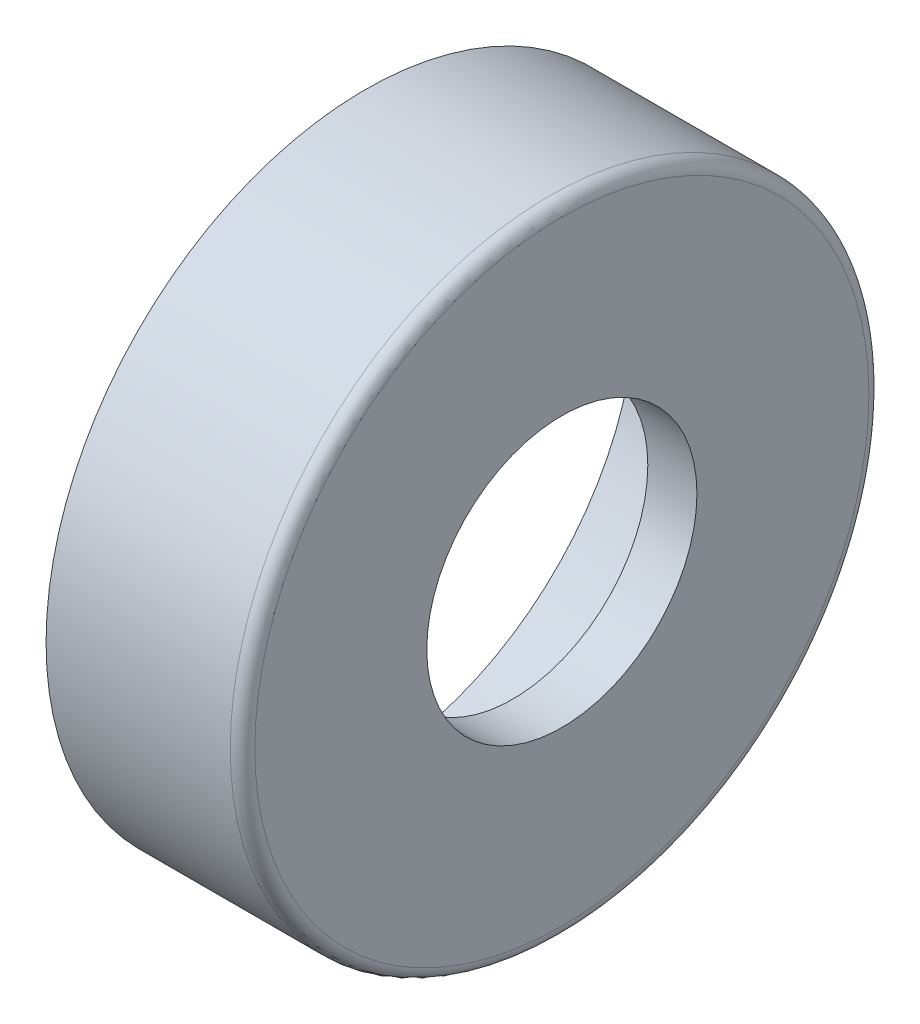
ISO-10303-21;
HEADER;
FILE_DESCRIPTION(('STEP AP214'),'2;1');
FILE_NAME('part.step','',(''),(''),'','','');
FILE_SCHEMA(('AUTOMOTIVE_DESIGN { 1 0 10303 214 1 1 1 1 }'));
ENDSEC;
DATA;
#1=APPLICATION_CONTEXT('core data for automotive mechanical design processes');
#2=APPLICATION_PROTOCOL_DEFINITION('international standard','automotive_design',2000,#1);
#3=PRODUCT_CONTEXT('',#1,'mechanical');
#4=PRODUCT('Part','Part','',(#3));
#5=PRODUCT_RELATED_PRODUCT_CATEGORY('part','',(#4));
#6=PRODUCT_DEFINITION_FORMATION('','',#4);
#7=PRODUCT_DEFINITION_CONTEXT('part definition',#1,'design');
#8=PRODUCT_DEFINITION('design','',#6,#7);
#9=PRODUCT_DEFINITION_SHAPE('','',#8);
#10=(LENGTH_UNIT() NAMED_UNIT(*) SI_UNIT(.MILLI.,.METRE.));
#11=(NAMED_UNIT(*) PLANE_ANGLE_UNIT() SI_UNIT($,.RADIAN.));
#12=(NAMED_UNIT(*) SI_UNIT($,.STERADIAN.) SOLID_ANGLE_UNIT());
#13=UNCERTAINTY_MEASURE_WITH_UNIT(LENGTH_MEASURE(1.E-05),#10,'distance_accuracy_value','');
#14=(GEOMETRIC_REPRESENTATION_CONTEXT(3) GLOBAL_UNCERTAINTY_ASSIGNED_CONTEXT((#13)) GLOBAL_UNIT_ASSIGNED_CONTEXT((#10,
#11,#12)) REPRESENTATION_CONTEXT('',''));
#15=CARTESIAN_POINT('',(0.,0.,0.));
#16=DIRECTION('',(0.,0.,1.));
#17=DIRECTION('',(1.,0.,0.));
#18=AXIS2_PLACEMENT_3D('',#15,#16,#17);
#19=CARTESIAN_POINT('',(-3.5,13.0000000000001,1.11022302462516E-13));
#20=DIRECTION('',(1.,0.,0.));
#21=DIRECTION('',(0.,0.,-1.00000000000001));
#22=AXIS2_PLACEMENT_3D('',#19,#20,#21);
#23=PLANE('',#22);
#24=CARTESIAN_POINT('',(-3.5,0.,1.11022302462516E-13));
#25=DIRECTION('',(-1.,0.,0.));
#26=DIRECTION('',(0.,0.,1.00000000000001));
#27=AXIS2_PLACEMENT_3D('',#24,#25,#26);
#28=CIRCLE('',#27,11.);
#29=CARTESIAN_POINT('',(-3.5,0.,11.0000000000002));
#30=VERTEX_POINT('',#29);
#31=EDGE_CURVE('E34',#30,#30,#28,.T.);
#32=ORIENTED_EDGE('',*,*,#31,.F.);
#33=EDGE_LOOP('',(#32));
#34=FACE_BOUND('',#33,.T.);
#35=CARTESIAN_POINT('',(-3.5,0.,1.11022302462516E-13));
#36=DIRECTION('',(-1.,0.,0.));
#37=DIRECTION('',(0.,0.,1.00000000000001));
#38=AXIS2_PLACEMENT_3D('',#35,#36,#37);
#39=CIRCLE('',#38,13.);
#40=CARTESIAN_POINT('',(-3.5,0.,13.0000000000003));
#41=VERTEX_POINT('',#40);
#42=EDGE_CURVE('E52',#41,#41,#39,.T.);
#43=ORIENTED_EDGE('',*,*,#42,.T.);
#44=EDGE_LOOP('',(#43));
#45=FACE_BOUND('',#44,.T.);
#46=ADVANCED_FACE('F24',(#34,#45),#23,.F.);
#47=CARTESIAN_POINT('',(-12.9863424565071,0.,0.));
#48=DIRECTION('',(-1.,0.,0.));
#49=DIRECTION('',(0.,0.,1.00000000000001));
#50=AXIS2_PLACEMENT_3D('',#47,#48,#49);
#51=CYLINDRICAL_SURFACE('',#50,11.);
#52=CARTESIAN_POINT('',(0.,0.,0.));
#53=DIRECTION('',(-1.,0.,0.));
#54=DIRECTION('',(0.,0.,1.00000000000001));
#55=AXIS2_PLACEMENT_3D('',#52,#53,#54);
#56=CIRCLE('',#55,11.);
#57=CARTESIAN_POINT('',(0.,0.,11.0000000000001));
#58=VERTEX_POINT('',#57);
#59=EDGE_CURVE('E38',#58,#58,#56,.T.);
#60=ORIENTED_EDGE('',*,*,#59,.F.);
#61=EDGE_LOOP('',(#60));
#62=FACE_BOUND('',#61,.T.);
#63=ORIENTED_EDGE('',*,*,#31,.T.);
#64=EDGE_LOOP('',(#63));
#65=FACE_BOUND('',#64,.T.);
#66=ADVANCED_FACE('F71',(#62,#65),#51,.F.);
#67=CARTESIAN_POINT('',(0.,0.,0.));
#68=DIRECTION('',(-1.,0.,0.));
#69=DIRECTION('',(0.,0.,1.00000000000001));
#70=AXIS2_PLACEMENT_3D('',#67,#68,#69);
#71=TOROIDAL_SURFACE('',#70,8.5,2.5);
#72=CARTESIAN_POINT('',(2.5,0.,0.));
#73=DIRECTION('',(-1.,0.,0.));
#74=DIRECTION('',(0.,0.,1.00000000000001));
#75=AXIS2_PLACEMENT_3D('',#72,#73,#74);
#76=CIRCLE('',#75,8.5);
#77=CARTESIAN_POINT('',(2.5,0.,8.50000000000009));
#78=VERTEX_POINT('',#77);
#79=EDGE_CURVE('E43',#78,#78,#76,.T.);
#80=ORIENTED_EDGE('',*,*,#79,.F.);
#81=EDGE_LOOP('',(#80));
#82=FACE_BOUND('',#81,.T.);
#83=ORIENTED_EDGE('',*,*,#59,.T.);
#84=EDGE_LOOP('',(#83));
#85=FACE_BOUND('',#84,.T.);
#86=ADVANCED_FACE('F76',(#82,#85),#71,.F.);
#87=CARTESIAN_POINT('',(2.5,5.50000000000005,0.));
#88=DIRECTION('',(1.,0.,0.));
#89=DIRECTION('',(0.,0.,-1.00000000000001));
#90=AXIS2_PLACEMENT_3D('',#87,#88,#89);
#91=PLANE('',#90);
#92=CARTESIAN_POINT('',(2.5,0.,0.));
#93=DIRECTION('',(-1.,0.,0.));
#94=DIRECTION('',(0.,0.,1.00000000000001));
#95=AXIS2_PLACEMENT_3D('',#92,#93,#94);
#96=CIRCLE('',#95,5.5);
#97=CARTESIAN_POINT('',(2.5,0.,5.50000000000006));
#98=VERTEX_POINT('',#97);
#99=EDGE_CURVE('E46',#98,#98,#96,.T.);
#100=ORIENTED_EDGE('',*,*,#99,.F.);
#101=EDGE_LOOP('',(#100));
#102=FACE_BOUND('',#101,.T.);
#103=ORIENTED_EDGE('',*,*,#79,.T.);
#104=EDGE_LOOP('',(#103));
#105=FACE_BOUND('',#104,.T.);
#106=ADVANCED_FACE('F83',(#102,#105),#91,.F.);
#107=CARTESIAN_POINT('',(-12.9863424565071,0.,0.));
#108=DIRECTION('',(-1.,0.,0.));
#109=DIRECTION('',(0.,0.,1.00000000000001));
#110=AXIS2_PLACEMENT_3D('',#107,#108,#109);
#111=CYLINDRICAL_SURFACE('',#110,5.5);
#112=CARTESIAN_POINT('',(4.49999999999999,0.,2.22044604925031E-13));
#113=DIRECTION('',(-1.,0.,0.));
#114=DIRECTION('',(0.,0.,1.00000000000001));
#115=AXIS2_PLACEMENT_3D('',#112,#113,#114);
#116=CIRCLE('',#115,5.5);
#117=CARTESIAN_POINT('',(4.49999999999999,0.,5.50000000000028));
#118=VERTEX_POINT('',#117);
#119=EDGE_CURVE('E49',#118,#118,#116,.T.);
#120=ORIENTED_EDGE('',*,*,#119,.F.);
#121=EDGE_LOOP('',(#120));
#122=FACE_BOUND('',#121,.T.);
#123=ORIENTED_EDGE('',*,*,#99,.T.);
#124=EDGE_LOOP('',(#123));
#125=FACE_BOUND('',#124,.T.);
#126=ADVANCED_FACE('F68',(#122,#125),#111,.F.);
#127=CARTESIAN_POINT('',(4.49999999999999,13.0000000000001,1.11022302462516E-13));
#128=DIRECTION('',(-1.,0.,0.));
#129=DIRECTION('',(0.,0.,1.00000000000001));
#130=AXIS2_PLACEMENT_3D('',#127,#128,#129);
#131=PLANE('',#130);
#132=CARTESIAN_POINT('',(4.49999999999999,0.,2.22044604925031E-13));
#133=DIRECTION('',(-1.,0.,0.));
#134=DIRECTION('',(0.,0.,1.00000000000001));
#135=AXIS2_PLACEMENT_3D('',#132,#133,#134);
#136=CIRCLE('',#135,12.5);
#137=CARTESIAN_POINT('',(4.49999999999999,0.,12.5000000000004));
#138=VERTEX_POINT('',#137);
#139=EDGE_CURVE('E10',#138,#138,#136,.F.);
#140=ORIENTED_EDGE('',*,*,#139,.T.);
#141=EDGE_LOOP('',(#140));
#142=FACE_BOUND('',#141,.T.);
#143=ORIENTED_EDGE('',*,*,#119,.T.);
#144=EDGE_LOOP('',(#143));
#145=FACE_BOUND('',#144,.T.);
#146=ADVANCED_FACE('F60',(#142,#145),#131,.F.);
#147=CARTESIAN_POINT('',(-12.9863424565071,0.,0.));
#148=DIRECTION('',(-1.,0.,0.));
#149=DIRECTION('',(0.,0.,1.00000000000001));
#150=AXIS2_PLACEMENT_3D('',#147,#148,#149);
#151=CYLINDRICAL_SURFACE('',#150,13.);
#152=CARTESIAN_POINT('',(4.,0.,0.));
#153=DIRECTION('',(-1.,0.,0.));
#154=DIRECTION('',(0.,0.,1.00000000000001));
#155=AXIS2_PLACEMENT_3D('',#152,#153,#154);
#156=CIRCLE('',#155,13.);
#157=CARTESIAN_POINT('',(4.00000000000001,0.,13.0000000000001));
#158=VERTEX_POINT('',#157);
#159=EDGE_CURVE('E30',#158,#158,#156,.T.);
#160=ORIENTED_EDGE('',*,*,#159,.T.);
#161=EDGE_LOOP('',(#160));
#162=FACE_BOUND('',#161,.T.);
#163=ORIENTED_EDGE('',*,*,#42,.F.);
#164=EDGE_LOOP('',(#163));
#165=FACE_BOUND('',#164,.T.);
#166=ADVANCED_FACE('F57',(#162,#165),#151,.T.);
#167=CARTESIAN_POINT('',(4.,0.,0.));
#168=DIRECTION('',(-1.,0.,0.));
#169=DIRECTION('',(0.,0.,1.00000000000001));
#170=AXIS2_PLACEMENT_3D('',#167,#168,#169);
#171=TOROIDAL_SURFACE('',#170,12.5,0.5);
#172=ORIENTED_EDGE('',*,*,#139,.F.);
#173=EDGE_LOOP('',(#172));
#174=FACE_BOUND('',#173,.T.);
#175=ORIENTED_EDGE('',*,*,#159,.F.);
#176=EDGE_LOOP('',(#175));
#177=FACE_BOUND('',#176,.T.);
#178=ADVANCED_FACE('F59',(#174,#177),#171,.T.);
#179=CLOSED_SHELL('',(#46,#66,#86,#106,#126,#146,#166,#178));
#180=MANIFOLD_SOLID_BREP('B2',#179);
#181=ADVANCED_BREP_SHAPE_REPRESENTATION('',(#18,#180),#14);
#182=SHAPE_DEFINITION_REPRESENTATION(#9,#181);
ENDSEC;
END-ISO-10303-21;
